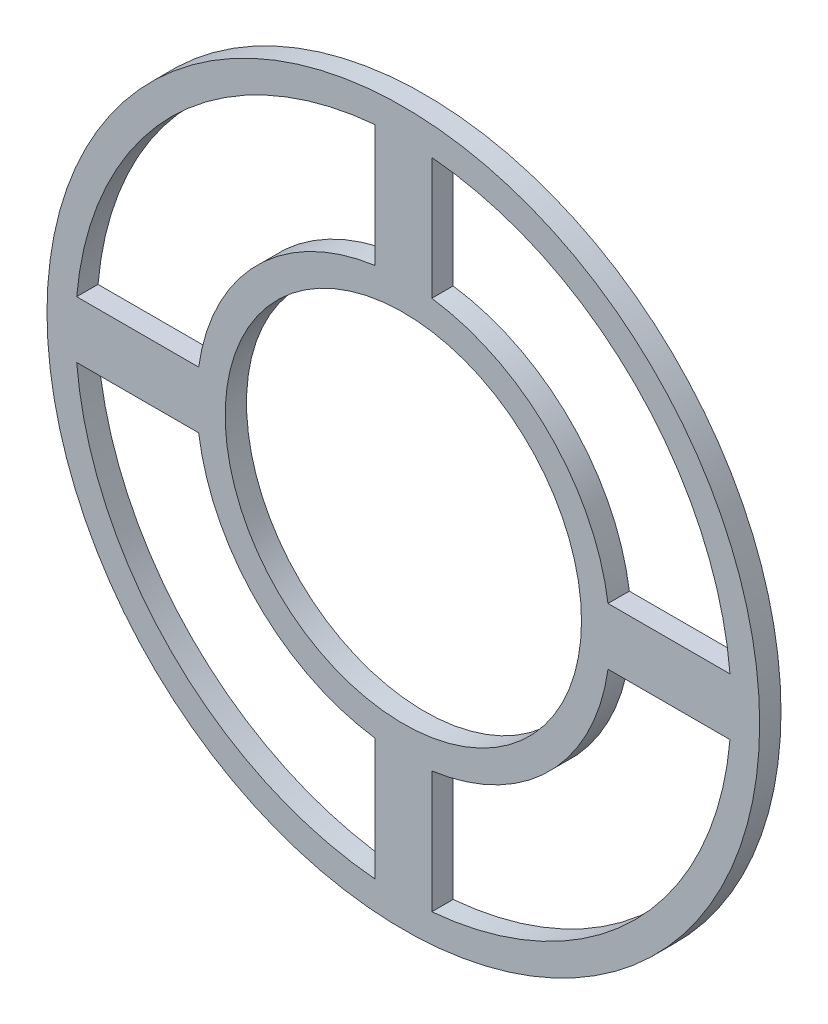
ISO-10303-21;
HEADER;
FILE_DESCRIPTION(('STEP AP214'),'2;1');
FILE_NAME('part.step','',(''),(''),'','','');
FILE_SCHEMA(('AUTOMOTIVE_DESIGN { 1 0 10303 214 1 1 1 1 }'));
ENDSEC;
DATA;
#1=APPLICATION_CONTEXT('core data for automotive mechanical design processes');
#2=APPLICATION_PROTOCOL_DEFINITION('international standard','automotive_design',2000,#1);
#3=PRODUCT_CONTEXT('',#1,'mechanical');
#4=PRODUCT('Part','Part','',(#3));
#5=PRODUCT_RELATED_PRODUCT_CATEGORY('part','',(#4));
#6=PRODUCT_DEFINITION_FORMATION('','',#4);
#7=PRODUCT_DEFINITION_CONTEXT('part definition',#1,'design');
#8=PRODUCT_DEFINITION('design','',#6,#7);
#9=PRODUCT_DEFINITION_SHAPE('','',#8);
#10=(LENGTH_UNIT() NAMED_UNIT(*) SI_UNIT(.MILLI.,.METRE.));
#11=(NAMED_UNIT(*) PLANE_ANGLE_UNIT() SI_UNIT($,.RADIAN.));
#12=(NAMED_UNIT(*) SI_UNIT($,.STERADIAN.) SOLID_ANGLE_UNIT());
#13=UNCERTAINTY_MEASURE_WITH_UNIT(LENGTH_MEASURE(1.E-05),#10,'distance_accuracy_value','');
#14=(GEOMETRIC_REPRESENTATION_CONTEXT(3) GLOBAL_UNCERTAINTY_ASSIGNED_CONTEXT((#13)) GLOBAL_UNIT_ASSIGNED_CONTEXT((#10,
#11,#12)) REPRESENTATION_CONTEXT('',''));
#15=CARTESIAN_POINT('',(0.,0.,0.));
#16=DIRECTION('',(0.,0.,1.));
#17=DIRECTION('',(1.,0.,0.));
#18=AXIS2_PLACEMENT_3D('',#15,#16,#17);
#19=CARTESIAN_POINT('',(0.,-6.3499999999998,4.7625));
#20=DIRECTION('',(0.,1.,0.));
#21=DIRECTION('',(-1.,0.,0.));
#22=AXIS2_PLACEMENT_3D('',#19,#20,#21);
#23=PLANE('',#22);
#24=DIRECTION('',(1.,0.,0.));
#25=VECTOR('',#24,1.);
#26=CARTESIAN_POINT('',(0.,-6.3499999999998,0.));
#27=LINE('',#26,#25);
#28=CARTESIAN_POINT('',(45.661577951271,-6.3499999999998,0.));
#29=VERTEX_POINT('',#28);
#30=CARTESIAN_POINT('',(72.8758712057702,-6.3499999999998,0.));
#31=VERTEX_POINT('',#30);
#32=EDGE_CURVE('E224',#29,#31,#27,.T.);
#33=ORIENTED_EDGE('',*,*,#32,.T.);
#34=DIRECTION('',(0.,0.,-1.));
#35=VECTOR('',#34,1.);
#36=CARTESIAN_POINT('',(72.8758712057702,-6.3499999999998,4.7625));
#37=LINE('',#36,#35);
#38=CARTESIAN_POINT('',(72.8758712057702,-6.3499999999998,4.7625));
#39=VERTEX_POINT('',#38);
#40=EDGE_CURVE('E11',#39,#31,#37,.T.);
#41=ORIENTED_EDGE('',*,*,#40,.F.);
#42=DIRECTION('',(1.,0.,0.));
#43=VECTOR('',#42,1.);
#44=CARTESIAN_POINT('',(0.,-6.3499999999998,4.7625));
#45=LINE('',#44,#43);
#46=CARTESIAN_POINT('',(45.661577951271,-6.3499999999998,4.7625));
#47=VERTEX_POINT('',#46);
#48=EDGE_CURVE('E172',#47,#39,#45,.T.);
#49=ORIENTED_EDGE('',*,*,#48,.F.);
#50=DIRECTION('',(0.,0.,-1.));
#51=VECTOR('',#50,1.);
#52=CARTESIAN_POINT('',(45.661577951271,-6.3499999999998,4.7625));
#53=LINE('',#52,#51);
#54=EDGE_CURVE('E230',#47,#29,#53,.T.);
#55=ORIENTED_EDGE('',*,*,#54,.T.);
#56=EDGE_LOOP('',(#33,#41,#49,#55));
#57=FACE_BOUND('',#56,.T.);
#58=ADVANCED_FACE('F39',(#57),#23,.F.);
#59=CARTESIAN_POINT('',(0.,0.,4.7625));
#60=DIRECTION('',(0.,0.,-1.));
#61=DIRECTION('',(-1.,0.,0.));
#62=AXIS2_PLACEMENT_3D('',#59,#60,#61);
#63=CYLINDRICAL_SURFACE('',#62,73.152);
#64=CARTESIAN_POINT('',(0.,0.,0.));
#65=DIRECTION('',(0.,0.,1.));
#66=DIRECTION('',(1.,0.,0.));
#67=AXIS2_PLACEMENT_3D('',#64,#65,#66);
#68=CIRCLE('',#67,73.152);
#69=CARTESIAN_POINT('',(6.34999999999981,-72.8758712057702,0.));
#70=VERTEX_POINT('',#69);
#71=EDGE_CURVE('E163',#70,#31,#68,.T.);
#72=ORIENTED_EDGE('',*,*,#71,.F.);
#73=DIRECTION('',(0.,0.,-1.));
#74=VECTOR('',#73,1.);
#75=CARTESIAN_POINT('',(6.34999999999981,-72.8758712057702,4.7625));
#76=LINE('',#75,#74);
#77=CARTESIAN_POINT('',(6.34999999999981,-72.8758712057702,4.7625));
#78=VERTEX_POINT('',#77);
#79=EDGE_CURVE('E49',#78,#70,#76,.T.);
#80=ORIENTED_EDGE('',*,*,#79,.F.);
#81=CARTESIAN_POINT('',(0.,0.,4.7625));
#82=DIRECTION('',(0.,0.,1.));
#83=DIRECTION('',(1.,0.,0.));
#84=AXIS2_PLACEMENT_3D('',#81,#82,#83);
#85=CIRCLE('',#84,73.152);
#86=EDGE_CURVE('E161',#78,#39,#85,.T.);
#87=ORIENTED_EDGE('',*,*,#86,.T.);
#88=ORIENTED_EDGE('',*,*,#40,.T.);
#89=EDGE_LOOP('',(#72,#80,#87,#88));
#90=FACE_BOUND('',#89,.T.);
#91=ADVANCED_FACE('F160',(#90),#63,.F.);
#92=CARTESIAN_POINT('',(6.3499999999998,0.,4.7625));
#93=DIRECTION('',(1.,0.,0.));
#94=DIRECTION('',(0.,1.,0.));
#95=AXIS2_PLACEMENT_3D('',#92,#93,#94);
#96=PLANE('',#95);
#97=DIRECTION('',(0.,-1.,0.));
#98=VECTOR('',#97,1.);
#99=CARTESIAN_POINT('',(6.3499999999998,0.,0.));
#100=LINE('',#99,#98);
#101=CARTESIAN_POINT('',(6.34999999999981,-45.661577951271,0.));
#102=VERTEX_POINT('',#101);
#103=EDGE_CURVE('E227',#102,#70,#100,.T.);
#104=ORIENTED_EDGE('',*,*,#103,.F.);
#105=DIRECTION('',(0.,0.,-1.));
#106=VECTOR('',#105,1.);
#107=CARTESIAN_POINT('',(6.34999999999981,-45.661577951271,4.7625));
#108=LINE('',#107,#106);
#109=CARTESIAN_POINT('',(6.34999999999981,-45.661577951271,4.7625));
#110=VERTEX_POINT('',#109);
#111=EDGE_CURVE('E109',#110,#102,#108,.T.);
#112=ORIENTED_EDGE('',*,*,#111,.F.);
#113=DIRECTION('',(0.,-1.,0.));
#114=VECTOR('',#113,1.);
#115=CARTESIAN_POINT('',(6.3499999999998,0.,4.7625));
#116=LINE('',#115,#114);
#117=EDGE_CURVE('E170',#110,#78,#116,.T.);
#118=ORIENTED_EDGE('',*,*,#117,.T.);
#119=ORIENTED_EDGE('',*,*,#79,.T.);
#120=EDGE_LOOP('',(#104,#112,#118,#119));
#121=FACE_BOUND('',#120,.T.);
#122=ADVANCED_FACE('F176',(#121),#96,.T.);
#123=CARTESIAN_POINT('',(-6.35000000000054,0.,4.7625));
#124=DIRECTION('',(-1.,0.,0.));
#125=DIRECTION('',(0.,-1.,0.));
#126=AXIS2_PLACEMENT_3D('',#123,#124,#125);
#127=PLANE('',#126);
#128=DIRECTION('',(0.,1.,0.));
#129=VECTOR('',#128,1.);
#130=CARTESIAN_POINT('',(-6.35000000000054,0.,0.));
#131=LINE('',#130,#129);
#132=CARTESIAN_POINT('',(-6.3500000000002,45.661577951271,0.));
#133=VERTEX_POINT('',#132);
#134=CARTESIAN_POINT('',(-6.35000000000001,72.8758712057701,0.));
#135=VERTEX_POINT('',#134);
#136=EDGE_CURVE('E212',#133,#135,#131,.T.);
#137=ORIENTED_EDGE('',*,*,#136,.F.);
#138=DIRECTION('',(0.,0.,-1.));
#139=VECTOR('',#138,1.);
#140=CARTESIAN_POINT('',(-6.3500000000002,45.661577951271,4.7625));
#141=LINE('',#140,#139);
#142=CARTESIAN_POINT('',(-6.3500000000002,45.661577951271,4.7625));
#143=VERTEX_POINT('',#142);
#144=EDGE_CURVE('E232',#143,#133,#141,.T.);
#145=ORIENTED_EDGE('',*,*,#144,.F.);
#146=DIRECTION('',(0.,1.,0.));
#147=VECTOR('',#146,1.);
#148=CARTESIAN_POINT('',(-6.35000000000054,0.,4.7625));
#149=LINE('',#148,#147);
#150=CARTESIAN_POINT('',(-6.35000000000001,72.8758712057701,4.7625));
#151=VERTEX_POINT('',#150);
#152=EDGE_CURVE('E298',#143,#151,#149,.T.);
#153=ORIENTED_EDGE('',*,*,#152,.T.);
#154=DIRECTION('',(0.,0.,-1.));
#155=VECTOR('',#154,1.);
#156=CARTESIAN_POINT('',(-6.35000000000001,72.8758712057701,4.7625));
#157=LINE('',#156,#155);
#158=EDGE_CURVE('E234',#151,#135,#157,.T.);
#159=ORIENTED_EDGE('',*,*,#158,.T.);
#160=EDGE_LOOP('',(#137,#145,#153,#159));
#161=FACE_BOUND('',#160,.T.);
#162=ADVANCED_FACE('F323',(#161),#127,.T.);
#163=CARTESIAN_POINT('',(0.,0.,4.7625));
#164=DIRECTION('',(0.,0.,-1.));
#165=DIRECTION('',(-1.,0.,0.));
#166=AXIS2_PLACEMENT_3D('',#163,#164,#165);
#167=CYLINDRICAL_SURFACE('',#166,46.101);
#168=CARTESIAN_POINT('',(0.,0.,0.));
#169=DIRECTION('',(0.,0.,1.));
#170=DIRECTION('',(1.,0.,0.));
#171=AXIS2_PLACEMENT_3D('',#168,#169,#170);
#172=CIRCLE('',#171,46.101);
#173=CARTESIAN_POINT('',(-45.661577951271,6.3499999999998,0.));
#174=VERTEX_POINT('',#173);
#175=EDGE_CURVE('E215',#133,#174,#172,.T.);
#176=ORIENTED_EDGE('',*,*,#175,.T.);
#177=DIRECTION('',(0.,0.,-1.));
#178=VECTOR('',#177,1.);
#179=CARTESIAN_POINT('',(-45.661577951271,6.3499999999998,4.7625));
#180=LINE('',#179,#178);
#181=CARTESIAN_POINT('',(-45.661577951271,6.3499999999998,4.7625));
#182=VERTEX_POINT('',#181);
#183=EDGE_CURVE('E239',#182,#174,#180,.T.);
#184=ORIENTED_EDGE('',*,*,#183,.F.);
#185=CARTESIAN_POINT('',(0.,0.,4.7625));
#186=DIRECTION('',(0.,0.,1.));
#187=DIRECTION('',(1.,0.,0.));
#188=AXIS2_PLACEMENT_3D('',#185,#186,#187);
#189=CIRCLE('',#188,46.101);
#190=EDGE_CURVE('E301',#143,#182,#189,.T.);
#191=ORIENTED_EDGE('',*,*,#190,.F.);
#192=ORIENTED_EDGE('',*,*,#144,.T.);
#193=EDGE_LOOP('',(#176,#184,#191,#192));
#194=FACE_BOUND('',#193,.T.);
#195=ADVANCED_FACE('F325',(#194),#167,.T.);
#196=CARTESIAN_POINT('',(0.,6.3499999999998,4.7625));
#197=DIRECTION('',(0.,-1.,0.));
#198=DIRECTION('',(0.,0.,-1.));
#199=AXIS2_PLACEMENT_3D('',#196,#197,#198);
#200=PLANE('',#199);
#201=DIRECTION('',(-1.,0.,0.));
#202=VECTOR('',#201,1.);
#203=CARTESIAN_POINT('',(0.,6.3499999999998,0.));
#204=LINE('',#203,#202);
#205=CARTESIAN_POINT('',(-72.8758712057702,6.3499999999998,0.));
#206=VERTEX_POINT('',#205);
#207=EDGE_CURVE('E218',#174,#206,#204,.T.);
#208=ORIENTED_EDGE('',*,*,#207,.T.);
#209=DIRECTION('',(0.,0.,-1.));
#210=VECTOR('',#209,1.);
#211=CARTESIAN_POINT('',(-72.8758712057702,6.3499999999998,4.7625));
#212=LINE('',#211,#210);
#213=CARTESIAN_POINT('',(-72.8758712057702,6.3499999999998,4.7625));
#214=VERTEX_POINT('',#213);
#215=EDGE_CURVE('E236',#214,#206,#212,.T.);
#216=ORIENTED_EDGE('',*,*,#215,.F.);
#217=DIRECTION('',(-1.,0.,0.));
#218=VECTOR('',#217,1.);
#219=CARTESIAN_POINT('',(0.,6.3499999999998,4.7625));
#220=LINE('',#219,#218);
#221=EDGE_CURVE('E304',#182,#214,#220,.T.);
#222=ORIENTED_EDGE('',*,*,#221,.F.);
#223=ORIENTED_EDGE('',*,*,#183,.T.);
#224=EDGE_LOOP('',(#208,#216,#222,#223));
#225=FACE_BOUND('',#224,.T.);
#226=ADVANCED_FACE('F317',(#225),#200,.F.);
#227=CARTESIAN_POINT('',(0.,0.,4.7625));
#228=DIRECTION('',(0.,0.,-1.));
#229=DIRECTION('',(-1.,0.,0.));
#230=AXIS2_PLACEMENT_3D('',#227,#228,#229);
#231=CYLINDRICAL_SURFACE('',#230,73.152);
#232=CARTESIAN_POINT('',(0.,0.,0.));
#233=DIRECTION('',(0.,0.,1.));
#234=DIRECTION('',(1.,0.,0.));
#235=AXIS2_PLACEMENT_3D('',#232,#233,#234);
#236=CIRCLE('',#235,73.152);
#237=CARTESIAN_POINT('',(-72.8758712057702,-6.3499999999998,0.));
#238=VERTEX_POINT('',#237);
#239=CARTESIAN_POINT('',(-6.3499999999998,-72.8758712057702,0.));
#240=VERTEX_POINT('',#239);
#241=EDGE_CURVE('E194',#238,#240,#236,.T.);
#242=ORIENTED_EDGE('',*,*,#241,.F.);
#243=DIRECTION('',(0.,0.,-1.));
#244=VECTOR('',#243,1.);
#245=CARTESIAN_POINT('',(-72.8758712057702,-6.3499999999998,4.7625));
#246=LINE('',#245,#244);
#247=CARTESIAN_POINT('',(-72.8758712057702,-6.3499999999998,4.7625));
#248=VERTEX_POINT('',#247);
#249=EDGE_CURVE('E237',#248,#238,#246,.T.);
#250=ORIENTED_EDGE('',*,*,#249,.F.);
#251=CARTESIAN_POINT('',(0.,0.,4.7625));
#252=DIRECTION('',(0.,0.,1.));
#253=DIRECTION('',(1.,0.,0.));
#254=AXIS2_PLACEMENT_3D('',#251,#252,#253);
#255=CIRCLE('',#254,73.152);
#256=CARTESIAN_POINT('',(-6.3499999999998,-72.8758712057702,4.7625));
#257=VERTEX_POINT('',#256);
#258=EDGE_CURVE('E276',#248,#257,#255,.T.);
#259=ORIENTED_EDGE('',*,*,#258,.T.);
#260=DIRECTION('',(0.,0.,-1.));
#261=VECTOR('',#260,1.);
#262=CARTESIAN_POINT('',(-6.3499999999998,-72.8758712057702,4.7625));
#263=LINE('',#262,#261);
#264=EDGE_CURVE('E243',#257,#240,#263,.T.);
#265=ORIENTED_EDGE('',*,*,#264,.T.);
#266=EDGE_LOOP('',(#242,#250,#259,#265));
#267=FACE_BOUND('',#266,.T.);
#268=ADVANCED_FACE('F332',(#267),#231,.F.);
#269=CARTESIAN_POINT('',(0.,-6.3499999999998,4.7625));
#270=DIRECTION('',(0.,-1.,0.));
#271=DIRECTION('',(1.,0.,0.));
#272=AXIS2_PLACEMENT_3D('',#269,#270,#271);
#273=PLANE('',#272);
#274=DIRECTION('',(-1.,0.,0.));
#275=VECTOR('',#274,1.);
#276=CARTESIAN_POINT('',(0.,-6.3499999999998,0.));
#277=LINE('',#276,#275);
#278=CARTESIAN_POINT('',(-45.661577951271,-6.3499999999998,0.));
#279=VERTEX_POINT('',#278);
#280=EDGE_CURVE('E197',#279,#238,#277,.T.);
#281=ORIENTED_EDGE('',*,*,#280,.F.);
#282=DIRECTION('',(0.,0.,-1.));
#283=VECTOR('',#282,1.);
#284=CARTESIAN_POINT('',(-45.661577951271,-6.3499999999998,4.7625));
#285=LINE('',#284,#283);
#286=CARTESIAN_POINT('',(-45.661577951271,-6.3499999999998,4.7625));
#287=VERTEX_POINT('',#286);
#288=EDGE_CURVE('E248',#287,#279,#285,.T.);
#289=ORIENTED_EDGE('',*,*,#288,.F.);
#290=DIRECTION('',(-1.,0.,0.));
#291=VECTOR('',#290,1.);
#292=CARTESIAN_POINT('',(0.,-6.3499999999998,4.7625));
#293=LINE('',#292,#291);
#294=EDGE_CURVE('E280',#287,#248,#293,.T.);
#295=ORIENTED_EDGE('',*,*,#294,.T.);
#296=ORIENTED_EDGE('',*,*,#249,.T.);
#297=EDGE_LOOP('',(#281,#289,#295,#296));
#298=FACE_BOUND('',#297,.T.);
#299=ADVANCED_FACE('F363',(#298),#273,.T.);
#300=CARTESIAN_POINT('',(0.,0.,4.7625));
#301=DIRECTION('',(0.,0.,-1.));
#302=DIRECTION('',(-1.,0.,0.));
#303=AXIS2_PLACEMENT_3D('',#300,#301,#302);
#304=CYLINDRICAL_SURFACE('',#303,46.101);
#305=CARTESIAN_POINT('',(0.,0.,0.));
#306=DIRECTION('',(0.,0.,1.));
#307=DIRECTION('',(1.,0.,0.));
#308=AXIS2_PLACEMENT_3D('',#305,#306,#307);
#309=CIRCLE('',#308,46.101);
#310=CARTESIAN_POINT('',(-6.3499999999998,-45.661577951271,0.));
#311=VERTEX_POINT('',#310);
#312=EDGE_CURVE('E200',#279,#311,#309,.T.);
#313=ORIENTED_EDGE('',*,*,#312,.T.);
#314=DIRECTION('',(0.,0.,-1.));
#315=VECTOR('',#314,1.);
#316=CARTESIAN_POINT('',(-6.3499999999998,-45.661577951271,4.7625));
#317=LINE('',#316,#315);
#318=CARTESIAN_POINT('',(-6.3499999999998,-45.661577951271,4.7625));
#319=VERTEX_POINT('',#318);
#320=EDGE_CURVE('E245',#319,#311,#317,.T.);
#321=ORIENTED_EDGE('',*,*,#320,.F.);
#322=CARTESIAN_POINT('',(0.,0.,4.7625));
#323=DIRECTION('',(0.,0.,1.));
#324=DIRECTION('',(1.,0.,0.));
#325=AXIS2_PLACEMENT_3D('',#322,#323,#324);
#326=CIRCLE('',#325,46.101);
#327=EDGE_CURVE('E287',#287,#319,#326,.T.);
#328=ORIENTED_EDGE('',*,*,#327,.F.);
#329=ORIENTED_EDGE('',*,*,#288,.T.);
#330=EDGE_LOOP('',(#313,#321,#328,#329));
#331=FACE_BOUND('',#330,.T.);
#332=ADVANCED_FACE('F367',(#331),#304,.T.);
#333=CARTESIAN_POINT('',(72.8758712057702,6.3499999999998,0.));
#334=VERTEX_POINT('',#333);
#335=CARTESIAN_POINT('',(6.35000000000021,72.8758712057701,0.));
#336=VERTEX_POINT('',#335);
#337=EDGE_CURVE('E183',#334,#336,#68,.T.);
#338=ORIENTED_EDGE('',*,*,#337,.F.);
#339=DIRECTION('',(0.,0.,-1.));
#340=VECTOR('',#339,1.);
#341=CARTESIAN_POINT('',(72.8758712057702,6.3499999999998,4.7625));
#342=LINE('',#341,#340);
#343=CARTESIAN_POINT('',(72.8758712057702,6.3499999999998,4.7625));
#344=VERTEX_POINT('',#343);
#345=EDGE_CURVE('E43',#344,#334,#342,.T.);
#346=ORIENTED_EDGE('',*,*,#345,.F.);
#347=CARTESIAN_POINT('',(6.35000000000021,72.8758712057701,4.7625));
#348=VERTEX_POINT('',#347);
#349=EDGE_CURVE('E175',#344,#348,#85,.T.);
#350=ORIENTED_EDGE('',*,*,#349,.T.);
#351=DIRECTION('',(0.,0.,-1.));
#352=VECTOR('',#351,1.);
#353=CARTESIAN_POINT('',(6.35000000000021,72.8758712057701,4.7625));
#354=LINE('',#353,#352);
#355=EDGE_CURVE('E178',#348,#336,#354,.T.);
#356=ORIENTED_EDGE('',*,*,#355,.T.);
#357=EDGE_LOOP('',(#338,#346,#350,#356));
#358=FACE_BOUND('',#357,.T.);
#359=ADVANCED_FACE('F263',(#358),#63,.F.);
#360=CARTESIAN_POINT('',(0.,6.3499999999998,4.7625));
#361=DIRECTION('',(0.,1.,0.));
#362=DIRECTION('',(-1.,0.,0.));
#363=AXIS2_PLACEMENT_3D('',#360,#361,#362);
#364=PLANE('',#363);
#365=DIRECTION('',(1.,0.,0.));
#366=VECTOR('',#365,1.);
#367=CARTESIAN_POINT('',(0.,6.3499999999998,0.));
#368=LINE('',#367,#366);
#369=CARTESIAN_POINT('',(45.661577951271,6.3499999999998,0.));
#370=VERTEX_POINT('',#369);
#371=EDGE_CURVE('E186',#370,#334,#368,.T.);
#372=ORIENTED_EDGE('',*,*,#371,.F.);
#373=DIRECTION('',(0.,0.,-1.));
#374=VECTOR('',#373,1.);
#375=CARTESIAN_POINT('',(45.661577951271,6.3499999999998,4.7625));
#376=LINE('',#375,#374);
#377=CARTESIAN_POINT('',(45.661577951271,6.3499999999998,4.7625));
#378=VERTEX_POINT('',#377);
#379=EDGE_CURVE('E254',#378,#370,#376,.T.);
#380=ORIENTED_EDGE('',*,*,#379,.F.);
#381=DIRECTION('',(1.,0.,0.));
#382=VECTOR('',#381,1.);
#383=CARTESIAN_POINT('',(0.,6.3499999999998,4.7625));
#384=LINE('',#383,#382);
#385=EDGE_CURVE('E262',#378,#344,#384,.T.);
#386=ORIENTED_EDGE('',*,*,#385,.T.);
#387=ORIENTED_EDGE('',*,*,#345,.T.);
#388=EDGE_LOOP('',(#372,#380,#386,#387));
#389=FACE_BOUND('',#388,.T.);
#390=ADVANCED_FACE('F41',(#389),#364,.T.);
#391=CARTESIAN_POINT('',(0.,0.,4.7625));
#392=DIRECTION('',(0.,0.,-1.));
#393=DIRECTION('',(-1.,0.,0.));
#394=AXIS2_PLACEMENT_3D('',#391,#392,#393);
#395=CYLINDRICAL_SURFACE('',#394,46.101);
#396=CARTESIAN_POINT('',(0.,0.,0.));
#397=DIRECTION('',(0.,0.,1.));
#398=DIRECTION('',(1.,0.,0.));
#399=AXIS2_PLACEMENT_3D('',#396,#397,#398);
#400=CIRCLE('',#399,46.101);
#401=CARTESIAN_POINT('',(6.35000000000001,45.661577951271,0.));
#402=VERTEX_POINT('',#401);
#403=EDGE_CURVE('E189',#370,#402,#400,.T.);
#404=ORIENTED_EDGE('',*,*,#403,.T.);
#405=DIRECTION('',(0.,0.,-1.));
#406=VECTOR('',#405,1.);
#407=CARTESIAN_POINT('',(6.35000000000001,45.661577951271,4.7625));
#408=LINE('',#407,#406);
#409=CARTESIAN_POINT('',(6.35000000000001,45.661577951271,4.7625));
#410=VERTEX_POINT('',#409);
#411=EDGE_CURVE('E252',#410,#402,#408,.T.);
#412=ORIENTED_EDGE('',*,*,#411,.F.);
#413=CARTESIAN_POINT('',(0.,0.,4.7625));
#414=DIRECTION('',(0.,0.,1.));
#415=DIRECTION('',(1.,0.,0.));
#416=AXIS2_PLACEMENT_3D('',#413,#414,#415);
#417=CIRCLE('',#416,46.101);
#418=EDGE_CURVE('E277',#378,#410,#417,.T.);
#419=ORIENTED_EDGE('',*,*,#418,.F.);
#420=ORIENTED_EDGE('',*,*,#379,.T.);
#421=EDGE_LOOP('',(#404,#412,#419,#420));
#422=FACE_BOUND('',#421,.T.);
#423=ADVANCED_FACE('F270',(#422),#395,.T.);
#424=CARTESIAN_POINT('',(0.,0.,4.7625));
#425=DIRECTION('',(0.,0.,-1.));
#426=DIRECTION('',(-1.,0.,0.));
#427=AXIS2_PLACEMENT_3D('',#424,#425,#426);
#428=CYLINDRICAL_SURFACE('',#427,73.152);
#429=CARTESIAN_POINT('',(0.,0.,0.));
#430=DIRECTION('',(0.,0.,1.));
#431=DIRECTION('',(1.,0.,0.));
#432=AXIS2_PLACEMENT_3D('',#429,#430,#431);
#433=CIRCLE('',#432,73.152);
#434=EDGE_CURVE('E221',#135,#206,#433,.T.);
#435=ORIENTED_EDGE('',*,*,#434,.F.);
#436=ORIENTED_EDGE('',*,*,#158,.F.);
#437=CARTESIAN_POINT('',(0.,0.,4.7625));
#438=DIRECTION('',(0.,0.,1.));
#439=DIRECTION('',(1.,0.,0.));
#440=AXIS2_PLACEMENT_3D('',#437,#438,#439);
#441=CIRCLE('',#440,73.152);
#442=EDGE_CURVE('E305',#151,#214,#441,.T.);
#443=ORIENTED_EDGE('',*,*,#442,.T.);
#444=ORIENTED_EDGE('',*,*,#215,.T.);
#445=EDGE_LOOP('',(#435,#436,#443,#444));
#446=FACE_BOUND('',#445,.T.);
#447=ADVANCED_FACE('F310',(#446),#428,.F.);
#448=CARTESIAN_POINT('',(0.,0.,4.7625));
#449=DIRECTION('',(0.,0.,-1.));
#450=DIRECTION('',(-1.,0.,0.));
#451=AXIS2_PLACEMENT_3D('',#448,#449,#450);
#452=CYLINDRICAL_SURFACE('',#451,79.502);
#453=CARTESIAN_POINT('',(0.,0.,4.7625));
#454=DIRECTION('',(0.,0.,1.));
#455=DIRECTION('',(1.,0.,0.));
#456=AXIS2_PLACEMENT_3D('',#453,#454,#455);
#457=CIRCLE('',#456,79.502);
#458=CARTESIAN_POINT('',(79.502,0.,4.7625));
#459=VERTEX_POINT('',#458);
#460=EDGE_CURVE('E295',#459,#459,#457,.T.);
#461=ORIENTED_EDGE('',*,*,#460,.F.);
#462=EDGE_LOOP('',(#461));
#463=FACE_BOUND('',#462,.T.);
#464=CARTESIAN_POINT('',(0.,0.,0.));
#465=DIRECTION('',(0.,0.,1.));
#466=DIRECTION('',(1.,0.,0.));
#467=AXIS2_PLACEMENT_3D('',#464,#465,#466);
#468=CIRCLE('',#467,79.502);
#469=CARTESIAN_POINT('',(79.502,0.,0.));
#470=VERTEX_POINT('',#469);
#471=EDGE_CURVE('E209',#470,#470,#468,.T.);
#472=ORIENTED_EDGE('',*,*,#471,.T.);
#473=EDGE_LOOP('',(#472));
#474=FACE_BOUND('',#473,.T.);
#475=ADVANCED_FACE('F345',(#463,#474),#452,.T.);
#476=CARTESIAN_POINT('',(0.,0.,4.7625));
#477=DIRECTION('',(0.,0.,-1.));
#478=DIRECTION('',(-1.,0.,0.));
#479=AXIS2_PLACEMENT_3D('',#476,#477,#478);
#480=CYLINDRICAL_SURFACE('',#479,39.751);
#481=CARTESIAN_POINT('',(0.,0.,4.7625));
#482=DIRECTION('',(0.,0.,1.));
#483=DIRECTION('',(1.,0.,0.));
#484=AXIS2_PLACEMENT_3D('',#481,#482,#483);
#485=CIRCLE('',#484,39.751);
#486=CARTESIAN_POINT('',(39.751,0.,4.7625));
#487=VERTEX_POINT('',#486);
#488=EDGE_CURVE('E292',#487,#487,#485,.T.);
#489=ORIENTED_EDGE('',*,*,#488,.T.);
#490=EDGE_LOOP('',(#489));
#491=FACE_BOUND('',#490,.T.);
#492=CARTESIAN_POINT('',(0.,0.,0.));
#493=DIRECTION('',(0.,0.,1.));
#494=DIRECTION('',(1.,0.,0.));
#495=AXIS2_PLACEMENT_3D('',#492,#493,#494);
#496=CIRCLE('',#495,39.751);
#497=CARTESIAN_POINT('',(39.751,0.,0.));
#498=VERTEX_POINT('',#497);
#499=EDGE_CURVE('E206',#498,#498,#496,.T.);
#500=ORIENTED_EDGE('',*,*,#499,.F.);
#501=EDGE_LOOP('',(#500));
#502=FACE_BOUND('',#501,.T.);
#503=ADVANCED_FACE('F350',(#491,#502),#480,.F.);
#504=CARTESIAN_POINT('',(-6.3499999999998,0.,4.7625));
#505=DIRECTION('',(1.,0.,0.));
#506=DIRECTION('',(0.,0.,-1.));
#507=AXIS2_PLACEMENT_3D('',#504,#505,#506);
#508=PLANE('',#507);
#509=DIRECTION('',(0.,-1.,0.));
#510=VECTOR('',#509,1.);
#511=CARTESIAN_POINT('',(-6.3499999999998,0.,0.));
#512=LINE('',#511,#510);
#513=EDGE_CURVE('E203',#311,#240,#512,.T.);
#514=ORIENTED_EDGE('',*,*,#513,.T.);
#515=ORIENTED_EDGE('',*,*,#264,.F.);
#516=DIRECTION('',(0.,-1.,0.));
#517=VECTOR('',#516,1.);
#518=CARTESIAN_POINT('',(-6.3499999999998,0.,4.7625));
#519=LINE('',#518,#517);
#520=EDGE_CURVE('E290',#319,#257,#519,.T.);
#521=ORIENTED_EDGE('',*,*,#520,.F.);
#522=ORIENTED_EDGE('',*,*,#320,.T.);
#523=EDGE_LOOP('',(#514,#515,#521,#522));
#524=FACE_BOUND('',#523,.T.);
#525=ADVANCED_FACE('F360',(#524),#508,.F.);
#526=CARTESIAN_POINT('',(6.34999999999968,0.,4.7625));
#527=DIRECTION('',(-1.,0.,0.));
#528=DIRECTION('',(0.,-1.,0.));
#529=AXIS2_PLACEMENT_3D('',#526,#527,#528);
#530=PLANE('',#529);
#531=DIRECTION('',(0.,1.,0.));
#532=VECTOR('',#531,1.);
#533=CARTESIAN_POINT('',(6.34999999999968,0.,0.));
#534=LINE('',#533,#532);
#535=EDGE_CURVE('E191',#402,#336,#534,.T.);
#536=ORIENTED_EDGE('',*,*,#535,.T.);
#537=ORIENTED_EDGE('',*,*,#355,.F.);
#538=DIRECTION('',(0.,1.,0.));
#539=VECTOR('',#538,1.);
#540=CARTESIAN_POINT('',(6.34999999999968,0.,4.7625));
#541=LINE('',#540,#539);
#542=EDGE_CURVE('E274',#410,#348,#541,.T.);
#543=ORIENTED_EDGE('',*,*,#542,.F.);
#544=ORIENTED_EDGE('',*,*,#411,.T.);
#545=EDGE_LOOP('',(#536,#537,#543,#544));
#546=FACE_BOUND('',#545,.T.);
#547=ADVANCED_FACE('F273',(#546),#530,.F.);
#548=CARTESIAN_POINT('',(0.,0.,4.7625));
#549=DIRECTION('',(0.,0.,-1.));
#550=DIRECTION('',(-1.,0.,0.));
#551=AXIS2_PLACEMENT_3D('',#548,#549,#550);
#552=CYLINDRICAL_SURFACE('',#551,46.101);
#553=CARTESIAN_POINT('',(0.,0.,0.));
#554=DIRECTION('',(0.,0.,1.));
#555=DIRECTION('',(1.,0.,0.));
#556=AXIS2_PLACEMENT_3D('',#553,#554,#555);
#557=CIRCLE('',#556,46.101);
#558=EDGE_CURVE('E112',#102,#29,#557,.T.);
#559=ORIENTED_EDGE('',*,*,#558,.T.);
#560=ORIENTED_EDGE('',*,*,#54,.F.);
#561=CARTESIAN_POINT('',(0.,0.,4.7625));
#562=DIRECTION('',(0.,0.,1.));
#563=DIRECTION('',(1.,0.,0.));
#564=AXIS2_PLACEMENT_3D('',#561,#562,#563);
#565=CIRCLE('',#564,46.101);
#566=EDGE_CURVE('E58',#110,#47,#565,.T.);
#567=ORIENTED_EDGE('',*,*,#566,.F.);
#568=ORIENTED_EDGE('',*,*,#111,.T.);
#569=EDGE_LOOP('',(#559,#560,#567,#568));
#570=FACE_BOUND('',#569,.T.);
#571=ADVANCED_FACE('F359',(#570),#552,.T.);
#572=CARTESIAN_POINT('',(0.,0.,4.7625));
#573=DIRECTION('',(0.,0.,1.));
#574=DIRECTION('',(1.,0.,0.));
#575=AXIS2_PLACEMENT_3D('',#572,#573,#574);
#576=PLANE('',#575);
#577=ORIENTED_EDGE('',*,*,#349,.F.);
#578=ORIENTED_EDGE('',*,*,#385,.F.);
#579=ORIENTED_EDGE('',*,*,#418,.T.);
#580=ORIENTED_EDGE('',*,*,#542,.T.);
#581=EDGE_LOOP('',(#577,#578,#579,#580));
#582=FACE_BOUND('',#581,.T.);
#583=ORIENTED_EDGE('',*,*,#258,.F.);
#584=ORIENTED_EDGE('',*,*,#294,.F.);
#585=ORIENTED_EDGE('',*,*,#327,.T.);
#586=ORIENTED_EDGE('',*,*,#520,.T.);
#587=EDGE_LOOP('',(#583,#584,#585,#586));
#588=FACE_BOUND('',#587,.T.);
#589=ORIENTED_EDGE('',*,*,#488,.F.);
#590=EDGE_LOOP('',(#589));
#591=FACE_BOUND('',#590,.T.);
#592=ORIENTED_EDGE('',*,*,#460,.T.);
#593=EDGE_LOOP('',(#592));
#594=FACE_BOUND('',#593,.T.);
#595=ORIENTED_EDGE('',*,*,#152,.F.);
#596=ORIENTED_EDGE('',*,*,#190,.T.);
#597=ORIENTED_EDGE('',*,*,#221,.T.);
#598=ORIENTED_EDGE('',*,*,#442,.F.);
#599=EDGE_LOOP('',(#595,#596,#597,#598));
#600=FACE_BOUND('',#599,.T.);
#601=ORIENTED_EDGE('',*,*,#48,.T.);
#602=ORIENTED_EDGE('',*,*,#86,.F.);
#603=ORIENTED_EDGE('',*,*,#117,.F.);
#604=ORIENTED_EDGE('',*,*,#566,.T.);
#605=EDGE_LOOP('',(#601,#602,#603,#604));
#606=FACE_BOUND('',#605,.T.);
#607=ADVANCED_FACE('F169',(#582,#588,#591,#594,#600,#606),#576,.T.);
#608=CARTESIAN_POINT('',(0.,0.,0.));
#609=DIRECTION('',(0.,0.,1.));
#610=DIRECTION('',(1.,0.,0.));
#611=AXIS2_PLACEMENT_3D('',#608,#609,#610);
#612=PLANE('',#611);
#613=ORIENTED_EDGE('',*,*,#337,.T.);
#614=ORIENTED_EDGE('',*,*,#535,.F.);
#615=ORIENTED_EDGE('',*,*,#403,.F.);
#616=ORIENTED_EDGE('',*,*,#371,.T.);
#617=EDGE_LOOP('',(#613,#614,#615,#616));
#618=FACE_BOUND('',#617,.T.);
#619=ORIENTED_EDGE('',*,*,#241,.T.);
#620=ORIENTED_EDGE('',*,*,#513,.F.);
#621=ORIENTED_EDGE('',*,*,#312,.F.);
#622=ORIENTED_EDGE('',*,*,#280,.T.);
#623=EDGE_LOOP('',(#619,#620,#621,#622));
#624=FACE_BOUND('',#623,.T.);
#625=ORIENTED_EDGE('',*,*,#499,.T.);
#626=EDGE_LOOP('',(#625));
#627=FACE_BOUND('',#626,.T.);
#628=ORIENTED_EDGE('',*,*,#471,.F.);
#629=EDGE_LOOP('',(#628));
#630=FACE_BOUND('',#629,.T.);
#631=ORIENTED_EDGE('',*,*,#136,.T.);
#632=ORIENTED_EDGE('',*,*,#434,.T.);
#633=ORIENTED_EDGE('',*,*,#207,.F.);
#634=ORIENTED_EDGE('',*,*,#175,.F.);
#635=EDGE_LOOP('',(#631,#632,#633,#634));
#636=FACE_BOUND('',#635,.T.);
#637=ORIENTED_EDGE('',*,*,#32,.F.);
#638=ORIENTED_EDGE('',*,*,#558,.F.);
#639=ORIENTED_EDGE('',*,*,#103,.T.);
#640=ORIENTED_EDGE('',*,*,#71,.T.);
#641=EDGE_LOOP('',(#637,#638,#639,#640));
#642=FACE_BOUND('',#641,.T.);
#643=ADVANCED_FACE('F267',(#618,#624,#627,#630,#636,#642),#612,.F.);
#644=CLOSED_SHELL('',(#58,#91,#122,#162,#195,#226,#268,#299,#332,#359,#390,#423,#447,#475,#503,
#525,#547,#571,#607,#643));
#645=MANIFOLD_SOLID_BREP('B2',#644);
#646=ADVANCED_BREP_SHAPE_REPRESENTATION('',(#18,#645),#14);
#647=SHAPE_DEFINITION_REPRESENTATION(#9,#646);
ENDSEC;
END-ISO-10303-21;
